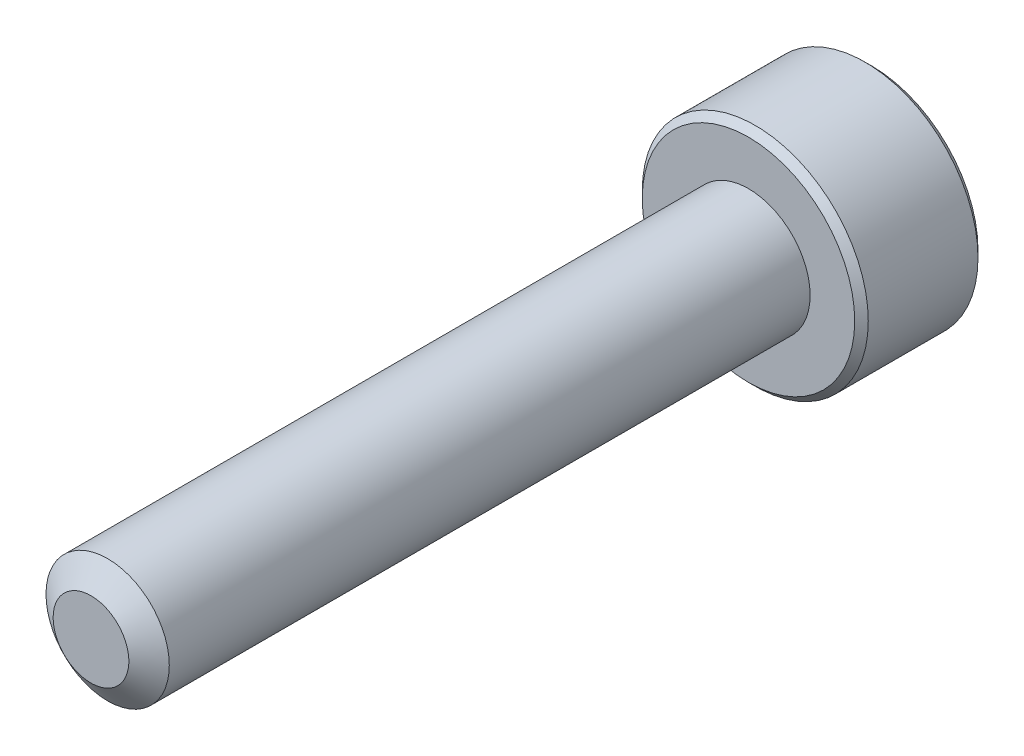
ISO-10303-21;
HEADER;
FILE_DESCRIPTION(('STEP AP214'),'2;1');
FILE_NAME('part.step','',(''),(''),'','','');
FILE_SCHEMA(('AUTOMOTIVE_DESIGN { 1 0 10303 214 1 1 1 1 }'));
ENDSEC;
DATA;
#1=APPLICATION_CONTEXT('core data for automotive mechanical design processes');
#2=APPLICATION_PROTOCOL_DEFINITION('international standard','automotive_design',2000,#1);
#3=PRODUCT_CONTEXT('',#1,'mechanical');
#4=PRODUCT('Part','Part','',(#3));
#5=PRODUCT_RELATED_PRODUCT_CATEGORY('part','',(#4));
#6=PRODUCT_DEFINITION_FORMATION('','',#4);
#7=PRODUCT_DEFINITION_CONTEXT('part definition',#1,'design');
#8=PRODUCT_DEFINITION('design','',#6,#7);
#9=PRODUCT_DEFINITION_SHAPE('','',#8);
#10=(LENGTH_UNIT() NAMED_UNIT(*) SI_UNIT(.MILLI.,.METRE.));
#11=(NAMED_UNIT(*) PLANE_ANGLE_UNIT() SI_UNIT($,.RADIAN.));
#12=(NAMED_UNIT(*) SI_UNIT($,.STERADIAN.) SOLID_ANGLE_UNIT());
#13=UNCERTAINTY_MEASURE_WITH_UNIT(LENGTH_MEASURE(1.E-05),#10,'distance_accuracy_value','');
#14=(GEOMETRIC_REPRESENTATION_CONTEXT(3) GLOBAL_UNCERTAINTY_ASSIGNED_CONTEXT((#13)) GLOBAL_UNIT_ASSIGNED_CONTEXT((#10,
#11,#12)) REPRESENTATION_CONTEXT('',''));
#15=CARTESIAN_POINT('',(0.,0.,0.));
#16=DIRECTION('',(0.,0.,1.));
#17=DIRECTION('',(1.,0.,0.));
#18=AXIS2_PLACEMENT_3D('',#15,#16,#17);
#19=CARTESIAN_POINT('',(0.,-1.44337567297406,-31.125));
#20=DIRECTION('',(-0.5,-0.866025403784439,0.));
#21=DIRECTION('',(0.866025403784439,-0.5,0.));
#22=AXIS2_PLACEMENT_3D('',#19,#20,#21);
#23=PLANE('',#22);
#24=CARTESIAN_POINT('',(-1.24999999999717,-0.721687836488642,-33.0000000000106));
#25=CARTESIAN_POINT('',(-1.20703689149332,-0.746492598748561,-32.9752190397288));
#26=CARTESIAN_POINT('',(-1.16335543595186,-0.771712098864021,-32.9518937494737));
#27=CARTESIAN_POINT('',(-1.07428446543453,-0.823137247669182,-32.9091861389212));
#28=CARTESIAN_POINT('',(-1.02888648443339,-0.849347784220857,-32.8898275733605));
#29=CARTESIAN_POINT('',(-0.937343688520888,-0.902200042083308,-32.8566662159147));
#30=CARTESIAN_POINT('',(-0.891222174140675,-0.928828310826158,-32.8427800967852));
#31=CARTESIAN_POINT('',(-0.797964038890889,-0.982670920316744,-32.8213859018018));
#32=CARTESIAN_POINT('',(-0.750830264933363,-1.00988361739904,-32.8138618619236));
#33=CARTESIAN_POINT('',(-0.669590913521704,-1.05678717880536,-32.8070728277983));
#34=CARTESIAN_POINT('',(-0.635590177984265,-1.07641751262054,-32.8060681886568));
#35=CARTESIAN_POINT('',(-0.567648554675288,-1.11564362712716,-32.8077634952234));
#36=CARTESIAN_POINT('',(-0.533707681782046,-1.1352393992286,-32.8104642592638));
#37=CARTESIAN_POINT('',(-0.466153619735556,-1.174241755136,-32.8194142483471));
#38=CARTESIAN_POINT('',(-0.432540764897232,-1.19364814592514,-32.8256667730594));
#39=CARTESIAN_POINT('',(-0.365876260757523,-1.23213691533559,-32.8413835392478));
#40=CARTESIAN_POINT('',(-0.332824858668344,-1.25121915122887,-32.8508491588607));
#41=CARTESIAN_POINT('',(-0.248213569936006,-1.30006950155497,-32.8789283315821));
#42=CARTESIAN_POINT('',(-0.197186124432366,-1.32953021095255,-32.8996493450654));
#43=CARTESIAN_POINT('',(-0.0971276056230598,-1.38729902372182,-32.9463235058208));
#44=CARTESIAN_POINT('',(-0.0480906425396526,-1.41561052755827,-32.9722596212326));
#45=CARTESIAN_POINT('',(-2.75812678191915E-12,-1.44337567297245,-33.0000000000106));
#46=B_SPLINE_CURVE_WITH_KNOTS('',3,(#24,#25,#26,#27,#28,#29,#30,#31,#32,#33,#34,#35,#36,#37,#38,
#39,#40,#41,#42,#43,#44,#45),.UNSPECIFIED.,.F.,.F.,(4,2,2,2,2,2,2,2,2,2,4),(0.,
0.166478683225086,0.333926926831293,0.49871665851616,0.663091654625532,0.780745575557483,
0.898425484350494,1.01621489976924,1.13405490052339,1.32111591641066,1.50757565757899),.UNSPECIFIED.);
#47=CARTESIAN_POINT('',(-1.25000000000136,-0.721687836486222,-33.000000000013));
#48=VERTEX_POINT('',#47);
#49=CARTESIAN_POINT('',(-4.1514466084769E-12,-1.44337567297487,-33.000000000013));
#50=VERTEX_POINT('',#49);
#51=EDGE_CURVE('E21',#48,#50,#46,.T.);
#52=ORIENTED_EDGE('',*,*,#51,.F.);
#53=DIRECTION('',(0.,0.,1.));
#54=VECTOR('',#53,1.);
#55=CARTESIAN_POINT('',(-1.24999999999997,-0.721687836487032,-31.125));
#56=LINE('',#55,#54);
#57=CARTESIAN_POINT('',(-1.24999999999997,-0.72168783648703,-31.125));
#58=VERTEX_POINT('',#57);
#59=EDGE_CURVE('E104',#48,#58,#56,.T.);
#60=ORIENTED_EDGE('',*,*,#59,.T.);
#61=DIRECTION('',(0.866025403784439,-0.5,0.));
#62=VECTOR('',#61,1.);
#63=CARTESIAN_POINT('',(0.,-1.44337567297406,-31.125));
#64=LINE('',#63,#62);
#65=CARTESIAN_POINT('',(0.,-1.44337567297406,-31.125));
#66=VERTEX_POINT('',#65);
#67=EDGE_CURVE('E77',#66,#58,#64,.F.);
#68=ORIENTED_EDGE('',*,*,#67,.F.);
#69=DIRECTION('',(0.,0.,1.));
#70=VECTOR('',#69,1.);
#71=CARTESIAN_POINT('',(0.,-1.44337567297407,-31.125));
#72=LINE('',#71,#70);
#73=EDGE_CURVE('E76',#66,#50,#72,.F.);
#74=ORIENTED_EDGE('',*,*,#73,.T.);
#75=EDGE_LOOP('',(#52,#60,#68,#74));
#76=FACE_BOUND('',#75,.T.);
#77=ADVANCED_FACE('F17',(#76),#23,.F.);
#78=CARTESIAN_POINT('',(1.25000000000004,-0.721687836487033,-31.125));
#79=DIRECTION('',(0.5,-0.866025403784439,0.));
#80=DIRECTION('',(0.866025403784439,0.5,0.));
#81=AXIS2_PLACEMENT_3D('',#78,#79,#80);
#82=PLANE('',#81);
#83=CARTESIAN_POINT('',(2.83489010956945E-12,-1.44337567297245,-33.0000000000106));
#84=CARTESIAN_POINT('',(0.042963108506678,-1.41857091071253,-32.9752190397288));
#85=CARTESIAN_POINT('',(0.0866445640481438,-1.39335141059707,-32.9518937494737));
#86=CARTESIAN_POINT('',(0.175715534565476,-1.34192626179191,-32.9091861389212));
#87=CARTESIAN_POINT('',(0.22111351556662,-1.31571572524024,-32.8898275733605));
#88=CARTESIAN_POINT('',(0.31265631147912,-1.26286346737778,-32.8566662159147));
#89=CARTESIAN_POINT('',(0.358777825859332,-1.23623519863493,-32.8427800967852));
#90=CARTESIAN_POINT('',(0.452035961109118,-1.18239258914435,-32.8213859018018));
#91=CARTESIAN_POINT('',(0.499169735066647,-1.15517989206205,-32.8138618619236));
#92=CARTESIAN_POINT('',(0.580409086478308,-1.10827633065573,-32.8070728277983));
#93=CARTESIAN_POINT('',(0.614409822015747,-1.08864599684055,-32.8060681886568));
#94=CARTESIAN_POINT('',(0.682351445324725,-1.04941988233393,-32.8077634952234));
#95=CARTESIAN_POINT('',(0.716292318217967,-1.02982411023248,-32.8104642592638));
#96=CARTESIAN_POINT('',(0.783846380264458,-0.99082175432509,-32.8194142483471));
#97=CARTESIAN_POINT('',(0.817459235102782,-0.971415363535952,-32.8256667730594));
#98=CARTESIAN_POINT('',(0.884123739242492,-0.932926594125497,-32.8413835392478));
#99=CARTESIAN_POINT('',(0.91717514133167,-0.913844358232215,-32.8508491588607));
#100=CARTESIAN_POINT('',(1.00178643006401,-0.864994007906121,-32.8789283315821));
#101=CARTESIAN_POINT('',(1.05281387556764,-0.835533298508536,-32.8996493450655));
#102=CARTESIAN_POINT('',(1.15287239437694,-0.777764485739271,-32.9463235058209));
#103=CARTESIAN_POINT('',(1.20190935746035,-0.749452981902827,-32.9722596212326));
#104=CARTESIAN_POINT('',(1.24999999999724,-0.721687836488652,-33.0000000000106));
#105=B_SPLINE_CURVE_WITH_KNOTS('',3,(#83,#84,#85,#86,#87,#88,#89,#90,#91,#92,#93,#94,#95,#96,
#97,#98,#99,#100,#101,#102,#103,#104),.UNSPECIFIED.,.F.,.F.,(4,2,2,2,2,2,2,2,2,2,4),(0.,
0.166478683225087,0.333926926831297,0.498716658516165,0.663091654625542,0.780745575557495,
0.898425484350506,1.01621489976925,1.1340549005234,1.32111591641067,1.50757565757898),.UNSPECIFIED.);
#106=CARTESIAN_POINT('',(1.24999999999864,-0.721687836491063,-33.000000000013));
#107=VERTEX_POINT('',#106);
#108=EDGE_CURVE('E84',#50,#107,#105,.T.);
#109=ORIENTED_EDGE('',*,*,#108,.F.);
#110=ORIENTED_EDGE('',*,*,#73,.F.);
#111=DIRECTION('',(-0.866025403784441,-0.499999999999996,0.));
#112=VECTOR('',#111,1.);
#113=CARTESIAN_POINT('',(1.25000000000004,-0.721687836487033,-31.125));
#114=LINE('',#113,#112);
#115=CARTESIAN_POINT('',(1.25000000000004,-0.721687836487033,-31.125));
#116=VERTEX_POINT('',#115);
#117=EDGE_CURVE('E272',#116,#66,#114,.T.);
#118=ORIENTED_EDGE('',*,*,#117,.F.);
#119=DIRECTION('',(0.,0.,-1.));
#120=VECTOR('',#119,1.);
#121=CARTESIAN_POINT('',(1.25000000000004,-0.721687836487033,-31.125));
#122=LINE('',#121,#120);
#123=EDGE_CURVE('E103',#116,#107,#122,.T.);
#124=ORIENTED_EDGE('',*,*,#123,.T.);
#125=EDGE_LOOP('',(#109,#110,#118,#124));
#126=FACE_BOUND('',#125,.T.);
#127=ADVANCED_FACE('F101',(#126),#82,.F.);
#128=CARTESIAN_POINT('',(-1.24999999999997,-0.721687836487032,-31.125));
#129=DIRECTION('',(-1.,0.,0.));
#130=DIRECTION('',(0.,-1.,0.));
#131=AXIS2_PLACEMENT_3D('',#128,#129,#130);
#132=PLANE('',#131);
#133=CARTESIAN_POINT('',(-1.24999999999997,0.721687836483799,-33.0000000000106));
#134=CARTESIAN_POINT('',(-1.24999999999997,0.672078311963963,-32.9752190397288));
#135=CARTESIAN_POINT('',(-1.24999999999997,0.621639311733045,-32.9518937494737));
#136=CARTESIAN_POINT('',(-1.24999999999997,0.518789014122723,-32.9091861389212));
#137=CARTESIAN_POINT('',(-1.24999999999997,0.466367941019373,-32.8898275733605));
#138=CARTESIAN_POINT('',(-1.24999999999997,0.360663425294469,-32.8566662159147));
#139=CARTESIAN_POINT('',(-1.24999999999997,0.307406887808772,-32.8427800967852));
#140=CARTESIAN_POINT('',(-1.24999999999997,0.199721668827599,-32.8213859018018));
#141=CARTESIAN_POINT('',(-1.24999999999997,0.145296274662995,-32.8138618619237));
#142=CARTESIAN_POINT('',(-1.24999999999997,0.0514891518503692,-32.8070728277983));
#143=CARTESIAN_POINT('',(-1.24999999999997,0.0122284842199978,-32.8060681886569));
#144=CARTESIAN_POINT('',(-1.24999999999997,-0.0662237447932393,-32.8077634952234));
#145=CARTESIAN_POINT('',(-1.24999999999997,-0.105415288996128,-32.8104642592638));
#146=CARTESIAN_POINT('',(-1.24999999999997,-0.183420000810916,-32.8194142483471));
#147=CARTESIAN_POINT('',(-1.24999999999997,-0.222232782389193,-32.8256667730594));
#148=CARTESIAN_POINT('',(-1.24999999999997,-0.299210321210101,-32.8413835392478));
#149=CARTESIAN_POINT('',(-1.24999999999997,-0.337374792996665,-32.8508491588607));
#150=CARTESIAN_POINT('',(-1.24999999999997,-0.435075493648856,-32.8789283315821));
#151=CARTESIAN_POINT('',(-1.24999999999997,-0.493996912444026,-32.8996493450655));
#152=CARTESIAN_POINT('',(-1.24999999999997,-0.609534537982556,-32.9463235058209));
#153=CARTESIAN_POINT('',(-1.24999999999997,-0.666157545655446,-32.9722596212326));
#154=CARTESIAN_POINT('',(-1.24999999999997,-0.721687836483798,-33.0000000000106));
#155=B_SPLINE_CURVE_WITH_KNOTS('',3,(#133,#134,#135,#136,#137,#138,#139,#140,#141,#142,#143,
#144,#145,#146,#147,#148,#149,#150,#151,#152,#153,#154),.UNSPECIFIED.,.F.,.F.,(4,2,2,2,2,2,2,2,
2,2,4),(0.,0.166478683225082,0.333926926831291,0.498716658516156,0.663091654625532,
0.780745575557485,0.898425484350496,1.01621489976924,1.13405490052339,1.32111591641066,
1.50757565757897),.UNSPECIFIED.);
#156=CARTESIAN_POINT('',(-1.24999999999997,0.721687836488636,-33.000000000013));
#157=VERTEX_POINT('',#156);
#158=EDGE_CURVE('E61',#157,#48,#155,.T.);
#159=ORIENTED_EDGE('',*,*,#158,.F.);
#160=DIRECTION('',(0.,0.,1.));
#161=VECTOR('',#160,1.);
#162=CARTESIAN_POINT('',(-1.24999999999997,0.721687836487032,-31.125));
#163=LINE('',#162,#161);
#164=CARTESIAN_POINT('',(-1.24999999999997,0.721687836487032,-31.125));
#165=VERTEX_POINT('',#164);
#166=EDGE_CURVE('E249',#157,#165,#163,.T.);
#167=ORIENTED_EDGE('',*,*,#166,.T.);
#168=DIRECTION('',(0.,1.,0.));
#169=VECTOR('',#168,1.);
#170=CARTESIAN_POINT('',(-1.24999999999997,2.1650635094611,-31.125));
#171=LINE('',#170,#169);
#172=EDGE_CURVE('E268',#58,#165,#171,.T.);
#173=ORIENTED_EDGE('',*,*,#172,.F.);
#174=ORIENTED_EDGE('',*,*,#59,.F.);
#175=EDGE_LOOP('',(#159,#167,#173,#174));
#176=FACE_BOUND('',#175,.T.);
#177=ADVANCED_FACE('F122',(#176),#132,.F.);
#178=CARTESIAN_POINT('',(1.25000000000004,2.1650635094611,-31.125));
#179=DIRECTION('',(0.,0.,-1.));
#180=DIRECTION('',(-1.,0.,0.));
#181=AXIS2_PLACEMENT_3D('',#178,#179,#180);
#182=PLANE('',#181);
#183=ORIENTED_EDGE('',*,*,#67,.T.);
#184=ORIENTED_EDGE('',*,*,#172,.T.);
#185=DIRECTION('',(-0.866025403784439,-0.5,0.));
#186=VECTOR('',#185,1.);
#187=CARTESIAN_POINT('',(-1.24999999999997,0.721687836487032,-31.125));
#188=LINE('',#187,#186);
#189=CARTESIAN_POINT('',(0.,1.44337567297406,-31.125));
#190=VERTEX_POINT('',#189);
#191=EDGE_CURVE('E144',#165,#190,#188,.F.);
#192=ORIENTED_EDGE('',*,*,#191,.T.);
#193=DIRECTION('',(-0.866025403784439,0.5,0.));
#194=VECTOR('',#193,1.);
#195=CARTESIAN_POINT('',(0.,1.44337567297406,-31.125));
#196=LINE('',#195,#194);
#197=CARTESIAN_POINT('',(1.25000000000004,0.721687836487027,-31.125));
#198=VERTEX_POINT('',#197);
#199=EDGE_CURVE('E246',#190,#198,#196,.F.);
#200=ORIENTED_EDGE('',*,*,#199,.T.);
#201=DIRECTION('',(0.,1.,0.));
#202=VECTOR('',#201,1.);
#203=CARTESIAN_POINT('',(1.25000000000004,0.721687836487032,-31.125));
#204=LINE('',#203,#202);
#205=EDGE_CURVE('E263',#198,#116,#204,.F.);
#206=ORIENTED_EDGE('',*,*,#205,.T.);
#207=ORIENTED_EDGE('',*,*,#117,.T.);
#208=EDGE_LOOP('',(#183,#184,#192,#200,#206,#207));
#209=FACE_BOUND('',#208,.T.);
#210=ADVANCED_FACE('F126',(#209),#182,.T.);
#211=CARTESIAN_POINT('',(1.25000000000004,0.721687836487032,-31.125));
#212=DIRECTION('',(1.,0.,0.));
#213=DIRECTION('',(0.,0.,-1.));
#214=AXIS2_PLACEMENT_3D('',#211,#212,#213);
#215=PLANE('',#214);
#216=CARTESIAN_POINT('',(1.25000000000004,-0.721687836483767,-33.0000000000107));
#217=CARTESIAN_POINT('',(1.25000000000004,-0.672078311963933,-32.9752190397289));
#218=CARTESIAN_POINT('',(1.25000000000004,-0.621639311733015,-32.9518937494738));
#219=CARTESIAN_POINT('',(1.25000000000004,-0.518789014122694,-32.9091861389213));
#220=CARTESIAN_POINT('',(1.25000000000004,-0.466367941019346,-32.8898275733605));
#221=CARTESIAN_POINT('',(1.25000000000004,-0.360663425294448,-32.8566662159147));
#222=CARTESIAN_POINT('',(1.25000000000004,-0.307406887808754,-32.8427800967852));
#223=CARTESIAN_POINT('',(1.25000000000004,-0.199721668827587,-32.8213859018019));
#224=CARTESIAN_POINT('',(1.25000000000004,-0.145296274662986,-32.8138618619237));
#225=CARTESIAN_POINT('',(1.25000000000004,-0.0514891518503633,-32.8070728277984));
#226=CARTESIAN_POINT('',(1.25000000000004,-0.0122284842199925,-32.8060681886569));
#227=CARTESIAN_POINT('',(1.25000000000004,0.0662237447932437,-32.8077634952235));
#228=CARTESIAN_POINT('',(1.25000000000004,0.105415288996132,-32.8104642592638));
#229=CARTESIAN_POINT('',(1.25000000000004,0.18342000081092,-32.8194142483472));
#230=CARTESIAN_POINT('',(1.25000000000004,0.222232782389196,-32.8256667730595));
#231=CARTESIAN_POINT('',(1.25000000000004,0.299210321210105,-32.8413835392478));
#232=CARTESIAN_POINT('',(1.25000000000004,0.337374792996669,-32.8508491588608));
#233=CARTESIAN_POINT('',(1.25000000000004,0.435075493649002,-32.8789283315823));
#234=CARTESIAN_POINT('',(1.25000000000004,0.493996912444308,-32.8996493450656));
#235=CARTESIAN_POINT('',(1.25000000000004,0.609534537983101,-32.9463235058212));
#236=CARTESIAN_POINT('',(1.25000000000004,0.666157545656118,-32.972259621233));
#237=CARTESIAN_POINT('',(1.25000000000004,0.721687836484593,-33.0000000000111));
#238=B_SPLINE_CURVE_WITH_KNOTS('',3,(#216,#217,#218,#219,#220,#221,#222,#223,#224,#225,#226,
#227,#228,#229,#230,#231,#232,#233,#234,#235,#236,#237),.UNSPECIFIED.,.F.,.F.,(4,2,2,2,2,2,2,2,
2,2,4),(0.,0.16647868322508,0.333926926831281,0.498716658516137,0.663091654625503,
0.780745575557454,0.898425484350464,1.01621489976921,1.13405490052336,1.32111591641107,
1.50757565757982),.UNSPECIFIED.);
#239=CARTESIAN_POINT('',(1.25000000000039,0.721687836488437,-33.0000000000132));
#240=VERTEX_POINT('',#239);
#241=EDGE_CURVE('E40',#107,#240,#238,.T.);
#242=ORIENTED_EDGE('',*,*,#241,.F.);
#243=ORIENTED_EDGE('',*,*,#123,.F.);
#244=ORIENTED_EDGE('',*,*,#205,.F.);
#245=DIRECTION('',(0.,0.,1.));
#246=VECTOR('',#245,1.);
#247=CARTESIAN_POINT('',(1.25000000000004,0.721687836487027,-31.125));
#248=LINE('',#247,#246);
#249=EDGE_CURVE('E242',#198,#240,#248,.F.);
#250=ORIENTED_EDGE('',*,*,#249,.T.);
#251=EDGE_LOOP('',(#242,#243,#244,#250));
#252=FACE_BOUND('',#251,.T.);
#253=ADVANCED_FACE('F130',(#252),#215,.F.);
#254=CARTESIAN_POINT('',(-1.24999999999997,0.721687836487032,-31.125));
#255=DIRECTION('',(-0.5,0.866025403784439,0.));
#256=DIRECTION('',(-0.866025403784439,-0.5,0.));
#257=AXIS2_PLACEMENT_3D('',#254,#255,#256);
#258=PLANE('',#257);
#259=CARTESIAN_POINT('',(-2.04579466972307E-12,1.44337567297287,-33.000000000011));
#260=CARTESIAN_POINT('',(-0.0429631085059339,1.41857091071292,-32.9752190397292));
#261=CARTESIAN_POINT('',(-0.0866445640474436,1.39335141059744,-32.951893749474));
#262=CARTESIAN_POINT('',(-0.175715534564866,1.34192626179222,-32.9091861389215));
#263=CARTESIAN_POINT('',(-0.221113515566057,1.31571572524052,-32.8898275733607));
#264=CARTESIAN_POINT('',(-0.312656311478655,1.26286346737801,-32.8566662159148));
#265=CARTESIAN_POINT('',(-0.358777825858918,1.23623519863513,-32.8427800967853));
#266=CARTESIAN_POINT('',(-0.452035961108808,1.18239258914449,-32.8213859018019));
#267=CARTESIAN_POINT('',(-0.499169735066388,1.15517989206215,-32.8138618619237));
#268=CARTESIAN_POINT('',(-0.580409086478104,1.10827633065581,-32.8070728277983));
#269=CARTESIAN_POINT('',(-0.614409822015546,1.08864599684062,-32.8060681886569));
#270=CARTESIAN_POINT('',(-0.682351445324528,1.049419882334,-32.8077634952234));
#271=CARTESIAN_POINT('',(-0.716292318217773,1.02982411023255,-32.8104642592637));
#272=CARTESIAN_POINT('',(-0.783846380264269,0.990821754325158,-32.8194142483471));
#273=CARTESIAN_POINT('',(-0.817459235102595,0.971415363536018,-32.8256667730594));
#274=CARTESIAN_POINT('',(-0.88412373924231,0.932926594125561,-32.8413835392477));
#275=CARTESIAN_POINT('',(-0.917175141331492,0.913844358232277,-32.8508491588606));
#276=CARTESIAN_POINT('',(-1.00178643006385,0.86499400790617,-32.8789283315821));
#277=CARTESIAN_POINT('',(-1.0528138755675,0.835533298508575,-32.8996493450654));
#278=CARTESIAN_POINT('',(-1.15287239437684,0.77776448573929,-32.9463235058208));
#279=CARTESIAN_POINT('',(-1.20190935746026,0.749452981902834,-32.9722596212326));
#280=CARTESIAN_POINT('',(-1.24999999999717,0.721687836488648,-33.0000000000106));
#281=B_SPLINE_CURVE_WITH_KNOTS('',3,(#259,#260,#261,#262,#263,#264,#265,#266,#267,#268,#269,
#270,#271,#272,#273,#274,#275,#276,#277,#278,#279,#280),.UNSPECIFIED.,.F.,.F.,(4,2,2,2,2,2,2,2,
2,2,4),(0.,0.166478683225279,0.333926926831687,0.498716658516747,0.663091654626309,
0.78074557555827,0.898425484351288,1.01621489977004,1.1340549005242,1.32111591641152,
1.50757565757991),.UNSPECIFIED.);
#282=CARTESIAN_POINT('',(-1.72312106275415E-12,1.44337567297508,-33.0000000000132));
#283=VERTEX_POINT('',#282);
#284=EDGE_CURVE('E145',#283,#157,#281,.T.);
#285=ORIENTED_EDGE('',*,*,#284,.F.);
#286=DIRECTION('',(0.,0.,1.));
#287=VECTOR('',#286,1.);
#288=CARTESIAN_POINT('',(0.,1.44337567297406,-31.125));
#289=LINE('',#288,#287);
#290=EDGE_CURVE('E170',#283,#190,#289,.T.);
#291=ORIENTED_EDGE('',*,*,#290,.T.);
#292=ORIENTED_EDGE('',*,*,#191,.F.);
#293=ORIENTED_EDGE('',*,*,#166,.F.);
#294=EDGE_LOOP('',(#285,#291,#292,#293));
#295=FACE_BOUND('',#294,.T.);
#296=ADVANCED_FACE('F135',(#295),#258,.F.);
#297=CARTESIAN_POINT('',(0.,1.44337567297406,-31.125));
#298=DIRECTION('',(0.5,0.866025403784439,0.));
#299=DIRECTION('',(-0.866025403784439,0.5,0.));
#300=AXIS2_PLACEMENT_3D('',#297,#298,#299);
#301=PLANE('',#300);
#302=CARTESIAN_POINT('',(2.11148663087512E-12,1.44337567297286,-33.000000000011));
#303=CARTESIAN_POINT('',(0.042963108505999,1.41857091071292,-32.9752190397292));
#304=CARTESIAN_POINT('',(0.0866445640475093,1.39335141059743,-32.951893749474));
#305=CARTESIAN_POINT('',(0.175715534564934,1.34192626179222,-32.9091861389215));
#306=CARTESIAN_POINT('',(0.221113515566127,1.31571572524051,-32.8898275733607));
#307=CARTESIAN_POINT('',(0.312656311478726,1.262863467378,-32.8566662159148));
#308=CARTESIAN_POINT('',(0.358777825858988,1.23623519863513,-32.8427800967853));
#309=CARTESIAN_POINT('',(0.452035961108878,1.18239258914448,-32.8213859018018));
#310=CARTESIAN_POINT('',(0.49916973506646,1.15517989206215,-32.8138618619237));
#311=CARTESIAN_POINT('',(0.580409086478177,1.1082763306558,-32.8070728277983));
#312=CARTESIAN_POINT('',(0.614409822015618,1.08864599684061,-32.8060681886568));
#313=CARTESIAN_POINT('',(0.6823514453246,1.04941988233399,-32.8077634952234));
#314=CARTESIAN_POINT('',(0.716292318217845,1.02982411023255,-32.8104642592637));
#315=CARTESIAN_POINT('',(0.78384638026434,0.99082175432515,-32.8194142483471));
#316=CARTESIAN_POINT('',(0.817459235102667,0.971415363536011,-32.8256667730594));
#317=CARTESIAN_POINT('',(0.884123739242382,0.932926594125553,-32.8413835392477));
#318=CARTESIAN_POINT('',(0.917175141331564,0.913844358232269,-32.8508491588606));
#319=CARTESIAN_POINT('',(1.00178643006405,0.864994007906088,-32.8789283315821));
#320=CARTESIAN_POINT('',(1.05281387556783,0.835533298508423,-32.8996493450655));
#321=CARTESIAN_POINT('',(1.1528723943774,0.777764485739001,-32.9463235058211));
#322=CARTESIAN_POINT('',(1.20190935746094,0.74945298190248,-32.9722596212329));
#323=CARTESIAN_POINT('',(1.24999999999795,0.72168783648823,-33.000000000011));
#324=B_SPLINE_CURVE_WITH_KNOTS('',3,(#302,#303,#304,#305,#306,#307,#308,#309,#310,#311,#312,
#313,#314,#315,#316,#317,#318,#319,#320,#321,#322,#323),.UNSPECIFIED.,.F.,.F.,(4,2,2,2,2,2,2,2,
2,2,4),(0.,0.166478683225283,0.333926926831696,0.498716658516754,0.66309165462632,
0.78074557555828,0.898425484351298,1.01621489977005,1.13405490052421,1.32111591641199,
1.50757565758083),.UNSPECIFIED.);
#325=EDGE_CURVE('E162',#283,#240,#324,.T.);
#326=ORIENTED_EDGE('',*,*,#325,.T.);
#327=ORIENTED_EDGE('',*,*,#249,.F.);
#328=ORIENTED_EDGE('',*,*,#199,.F.);
#329=ORIENTED_EDGE('',*,*,#290,.F.);
#330=EDGE_LOOP('',(#326,#327,#328,#329));
#331=FACE_BOUND('',#330,.T.);
#332=ADVANCED_FACE('F172',(#331),#301,.F.);
#333=CARTESIAN_POINT('',(0.,0.,-32.9999999999586));
#334=DIRECTION('',(0.,0.,-1.));
#335=DIRECTION('',(-1.,0.,0.));
#336=AXIS2_PLACEMENT_3D('',#333,#334,#335);
#337=CONICAL_SURFACE('',#336,1.44337567292045,0.785398163397448);
#338=ORIENTED_EDGE('',*,*,#284,.T.);
#339=CARTESIAN_POINT('',(0.,0.,-33.0000000000155));
#340=DIRECTION('',(0.,0.,-1.));
#341=DIRECTION('',(-1.,0.,0.));
#342=AXIS2_PLACEMENT_3D('',#339,#340,#341);
#343=CIRCLE('',#342,1.44337567297729);
#344=EDGE_CURVE('E169',#283,#157,#343,.F.);
#345=ORIENTED_EDGE('',*,*,#344,.F.);
#346=EDGE_LOOP('',(#338,#345));
#347=FACE_BOUND('',#346,.T.);
#348=ADVANCED_FACE('F175',(#347),#337,.F.);
#349=CARTESIAN_POINT('',(0.,0.,-32.9999999999586));
#350=DIRECTION('',(0.,0.,-1.));
#351=DIRECTION('',(-1.,0.,0.));
#352=AXIS2_PLACEMENT_3D('',#349,#350,#351);
#353=CONICAL_SURFACE('',#352,1.44337567292045,0.785398163397448);
#354=CARTESIAN_POINT('',(0.,0.,-33.0000000000155));
#355=DIRECTION('',(0.,0.,-1.));
#356=DIRECTION('',(-1.,0.,0.));
#357=AXIS2_PLACEMENT_3D('',#354,#355,#356);
#358=CIRCLE('',#357,1.44337567297729);
#359=EDGE_CURVE('E94',#157,#48,#358,.F.);
#360=ORIENTED_EDGE('',*,*,#359,.F.);
#361=ORIENTED_EDGE('',*,*,#158,.T.);
#362=EDGE_LOOP('',(#360,#361));
#363=FACE_BOUND('',#362,.T.);
#364=ADVANCED_FACE('F179',(#363),#353,.F.);
#365=CARTESIAN_POINT('',(0.,0.,-32.9999999999586));
#366=DIRECTION('',(0.,0.,-1.));
#367=DIRECTION('',(-1.,0.,0.));
#368=AXIS2_PLACEMENT_3D('',#365,#366,#367);
#369=CONICAL_SURFACE('',#368,1.44337567292045,0.785398163397448);
#370=ORIENTED_EDGE('',*,*,#51,.T.);
#371=CARTESIAN_POINT('',(0.,0.,-33.0000000000155));
#372=DIRECTION('',(0.,0.,-1.));
#373=DIRECTION('',(-1.,0.,0.));
#374=AXIS2_PLACEMENT_3D('',#371,#372,#373);
#375=CIRCLE('',#374,1.44337567297729);
#376=EDGE_CURVE('E72',#48,#50,#375,.F.);
#377=ORIENTED_EDGE('',*,*,#376,.F.);
#378=EDGE_LOOP('',(#370,#377));
#379=FACE_BOUND('',#378,.T.);
#380=ADVANCED_FACE('F70',(#379),#369,.F.);
#381=CARTESIAN_POINT('',(0.,0.,-32.9999999999586));
#382=DIRECTION('',(0.,0.,-1.));
#383=DIRECTION('',(-1.,0.,0.));
#384=AXIS2_PLACEMENT_3D('',#381,#382,#383);
#385=CONICAL_SURFACE('',#384,1.44337567292045,0.785398163397448);
#386=ORIENTED_EDGE('',*,*,#108,.T.);
#387=CARTESIAN_POINT('',(0.,0.,-33.0000000000155));
#388=DIRECTION('',(0.,0.,-1.));
#389=DIRECTION('',(-1.,0.,0.));
#390=AXIS2_PLACEMENT_3D('',#387,#388,#389);
#391=CIRCLE('',#390,1.44337567297729);
#392=EDGE_CURVE('E92',#50,#107,#391,.F.);
#393=ORIENTED_EDGE('',*,*,#392,.F.);
#394=EDGE_LOOP('',(#386,#393));
#395=FACE_BOUND('',#394,.T.);
#396=ADVANCED_FACE('F97',(#395),#385,.F.);
#397=CARTESIAN_POINT('',(0.,0.,-32.9999999999586));
#398=DIRECTION('',(0.,0.,-1.));
#399=DIRECTION('',(-1.,0.,0.));
#400=AXIS2_PLACEMENT_3D('',#397,#398,#399);
#401=CONICAL_SURFACE('',#400,1.44337567292038,0.785398163397448);
#402=ORIENTED_EDGE('',*,*,#241,.T.);
#403=CARTESIAN_POINT('',(0.,0.,-33.0000000000155));
#404=DIRECTION('',(0.,0.,-1.));
#405=DIRECTION('',(-1.,0.,0.));
#406=AXIS2_PLACEMENT_3D('',#403,#404,#405);
#407=CIRCLE('',#406,1.44337567297722);
#408=EDGE_CURVE('E99',#107,#240,#407,.F.);
#409=ORIENTED_EDGE('',*,*,#408,.F.);
#410=EDGE_LOOP('',(#402,#409));
#411=FACE_BOUND('',#410,.T.);
#412=ADVANCED_FACE('F152',(#411),#401,.F.);
#413=CARTESIAN_POINT('',(0.,0.,-32.9999999999586));
#414=DIRECTION('',(0.,0.,-1.));
#415=DIRECTION('',(-1.,0.,0.));
#416=AXIS2_PLACEMENT_3D('',#413,#414,#415);
#417=CONICAL_SURFACE('',#416,1.44337567292045,0.785398163397448);
#418=ORIENTED_EDGE('',*,*,#325,.F.);
#419=CARTESIAN_POINT('',(0.,0.,-33.0000000000155));
#420=DIRECTION('',(0.,0.,-1.));
#421=DIRECTION('',(-1.,0.,0.));
#422=AXIS2_PLACEMENT_3D('',#419,#420,#421);
#423=CIRCLE('',#422,1.44337567297729);
#424=EDGE_CURVE('E234',#240,#283,#423,.F.);
#425=ORIENTED_EDGE('',*,*,#424,.F.);
#426=EDGE_LOOP('',(#418,#425));
#427=FACE_BOUND('',#426,.T.);
#428=ADVANCED_FACE('F156',(#427),#417,.F.);
#429=CARTESIAN_POINT('',(0.,0.,-33.));
#430=DIRECTION('',(0.,0.,-1.));
#431=DIRECTION('',(-1.,0.,0.));
#432=AXIS2_PLACEMENT_3D('',#429,#430,#431);
#433=PLANE('',#432);
#434=ORIENTED_EDGE('',*,*,#408,.T.);
#435=ORIENTED_EDGE('',*,*,#424,.T.);
#436=ORIENTED_EDGE('',*,*,#344,.T.);
#437=ORIENTED_EDGE('',*,*,#359,.T.);
#438=ORIENTED_EDGE('',*,*,#376,.T.);
#439=ORIENTED_EDGE('',*,*,#392,.T.);
#440=EDGE_LOOP('',(#434,#435,#436,#437,#438,#439));
#441=FACE_BOUND('',#440,.T.);
#442=CARTESIAN_POINT('',(0.,0.,-33.0000000000154));
#443=DIRECTION('',(0.,0.,1.));
#444=DIRECTION('',(1.,0.,0.));
#445=AXIS2_PLACEMENT_3D('',#442,#443,#444);
#446=CIRCLE('',#445,2.58500000006734);
#447=CARTESIAN_POINT('',(2.58500000006737,0.,-33.0000000000154));
#448=VERTEX_POINT('',#447);
#449=EDGE_CURVE('E225',#448,#448,#446,.T.);
#450=ORIENTED_EDGE('',*,*,#449,.F.);
#451=EDGE_LOOP('',(#450));
#452=FACE_BOUND('',#451,.T.);
#453=ADVANCED_FACE('F90',(#441,#452),#433,.T.);
#454=CARTESIAN_POINT('',(0.,0.,-32.8350000000341));
#455=DIRECTION('',(0.,0.,1.));
#456=DIRECTION('',(1.,0.,0.));
#457=AXIS2_PLACEMENT_3D('',#454,#455,#456);
#458=CONICAL_SURFACE('',#457,2.75000000004862,0.785398163397448);
#459=ORIENTED_EDGE('',*,*,#449,.T.);
#460=EDGE_LOOP('',(#459));
#461=FACE_BOUND('',#460,.T.);
#462=CARTESIAN_POINT('',(0.,0.,-32.835));
#463=DIRECTION('',(0.,0.,1.));
#464=DIRECTION('',(1.,0.,0.));
#465=AXIS2_PLACEMENT_3D('',#462,#463,#464);
#466=CIRCLE('',#465,2.75);
#467=CARTESIAN_POINT('',(2.75000000000004,0.,-32.835));
#468=VERTEX_POINT('',#467);
#469=EDGE_CURVE('E228',#468,#468,#466,.T.);
#470=ORIENTED_EDGE('',*,*,#469,.F.);
#471=EDGE_LOOP('',(#470));
#472=FACE_BOUND('',#471,.T.);
#473=ADVANCED_FACE('F215',(#461,#472),#458,.T.);
#474=CARTESIAN_POINT('',(0.,0.,-33.));
#475=DIRECTION('',(0.,0.,1.));
#476=DIRECTION('',(1.,0.,0.));
#477=AXIS2_PLACEMENT_3D('',#474,#475,#476);
#478=CYLINDRICAL_SURFACE('',#477,2.75);
#479=ORIENTED_EDGE('',*,*,#469,.T.);
#480=EDGE_LOOP('',(#479));
#481=FACE_BOUND('',#480,.T.);
#482=CARTESIAN_POINT('',(0.,0.,-30.1650000000109));
#483=DIRECTION('',(0.,0.,-1.));
#484=DIRECTION('',(-1.,0.,0.));
#485=AXIS2_PLACEMENT_3D('',#482,#483,#484);
#486=CIRCLE('',#485,2.74999999999185);
#487=CARTESIAN_POINT('',(-2.74999999999181,0.,-30.1650000000109));
#488=VERTEX_POINT('',#487);
#489=EDGE_CURVE('E229',#488,#488,#486,.F.);
#490=ORIENTED_EDGE('',*,*,#489,.F.);
#491=EDGE_LOOP('',(#490));
#492=FACE_BOUND('',#491,.T.);
#493=ADVANCED_FACE('F212',(#481,#492),#478,.T.);
#494=CARTESIAN_POINT('',(0.,0.,-14.));
#495=DIRECTION('',(0.,0.,1.));
#496=DIRECTION('',(1.,0.,0.));
#497=AXIS2_PLACEMENT_3D('',#494,#495,#496);
#498=PLANE('',#497);
#499=CARTESIAN_POINT('',(0.,0.,-13.9999999999532));
#500=DIRECTION('',(0.,0.,-1.));
#501=DIRECTION('',(-1.,0.,0.));
#502=AXIS2_PLACEMENT_3D('',#499,#500,#501);
#503=CIRCLE('',#502,0.921240473587659);
#504=CARTESIAN_POINT('',(-0.921240473587661,0.,-13.9999999999532));
#505=VERTEX_POINT('',#504);
#506=EDGE_CURVE('E232',#505,#505,#503,.T.);
#507=ORIENTED_EDGE('',*,*,#506,.F.);
#508=EDGE_LOOP('',(#507));
#509=FACE_BOUND('',#508,.T.);
#510=ADVANCED_FACE('F208',(#509),#498,.T.);
#511=CARTESIAN_POINT('',(0.,0.,-30.1649999998972));
#512=DIRECTION('',(0.,0.,-1.));
#513=DIRECTION('',(-1.,0.,0.));
#514=AXIS2_PLACEMENT_3D('',#511,#512,#513);
#515=CONICAL_SURFACE('',#514,2.74999999993501,0.785398163569701);
#516=CARTESIAN_POINT('',(0.,0.,-30.0000000000295));
#517=DIRECTION('',(0.,0.,-1.));
#518=DIRECTION('',(-1.,0.,0.));
#519=AXIS2_PLACEMENT_3D('',#516,#517,#518);
#520=CIRCLE('',#519,2.5850000000105);
#521=CARTESIAN_POINT('',(-2.58500000001046,0.,-30.0000000000295));
#522=VERTEX_POINT('',#521);
#523=EDGE_CURVE('E287',#522,#522,#520,.T.);
#524=ORIENTED_EDGE('',*,*,#523,.T.);
#525=EDGE_LOOP('',(#524));
#526=FACE_BOUND('',#525,.T.);
#527=ORIENTED_EDGE('',*,*,#489,.T.);
#528=EDGE_LOOP('',(#527));
#529=FACE_BOUND('',#528,.T.);
#530=ADVANCED_FACE('F204',(#526,#529),#515,.T.);
#531=CARTESIAN_POINT('',(0.,0.,-14.4052517831597));
#532=DIRECTION('',(0.,0.,-1.));
#533=DIRECTION('',(-1.,0.,0.));
#534=AXIS2_PLACEMENT_3D('',#531,#532,#533);
#535=CONICAL_SURFACE('',#534,1.50000000002137,0.959931088612039);
#536=ORIENTED_EDGE('',*,*,#506,.T.);
#537=EDGE_LOOP('',(#536));
#538=FACE_BOUND('',#537,.T.);
#539=CARTESIAN_POINT('',(0.,0.,-14.4052517832094));
#540=DIRECTION('',(0.,0.,1.));
#541=DIRECTION('',(1.,0.,0.));
#542=AXIS2_PLACEMENT_3D('',#539,#540,#541);
#543=CIRCLE('',#542,1.5);
#544=CARTESIAN_POINT('',(1.5,0.,-14.4052517832094));
#545=VERTEX_POINT('',#544);
#546=EDGE_CURVE('E32',#545,#545,#543,.F.);
#547=ORIENTED_EDGE('',*,*,#546,.F.);
#548=EDGE_LOOP('',(#547));
#549=FACE_BOUND('',#548,.T.);
#550=ADVANCED_FACE('F197',(#538,#549),#535,.T.);
#551=CARTESIAN_POINT('',(0.,0.,-30.));
#552=DIRECTION('',(0.,0.,-1.));
#553=DIRECTION('',(-1.,0.,0.));
#554=AXIS2_PLACEMENT_3D('',#551,#552,#553);
#555=PLANE('',#554);
#556=CARTESIAN_POINT('',(0.,0.,-30.));
#557=DIRECTION('',(0.,0.,1.));
#558=DIRECTION('',(1.,0.,0.));
#559=AXIS2_PLACEMENT_3D('',#556,#557,#558);
#560=CIRCLE('',#559,1.5);
#561=CARTESIAN_POINT('',(1.5,0.,-30.));
#562=VERTEX_POINT('',#561);
#563=EDGE_CURVE('E11',#562,#562,#560,.T.);
#564=ORIENTED_EDGE('',*,*,#563,.F.);
#565=EDGE_LOOP('',(#564));
#566=FACE_BOUND('',#565,.T.);
#567=ORIENTED_EDGE('',*,*,#523,.F.);
#568=EDGE_LOOP('',(#567));
#569=FACE_BOUND('',#568,.T.);
#570=ADVANCED_FACE('F191',(#566,#569),#555,.F.);
#571=CARTESIAN_POINT('',(0.,0.,-40.));
#572=DIRECTION('',(0.,0.,1.));
#573=DIRECTION('',(1.,0.,0.));
#574=AXIS2_PLACEMENT_3D('',#571,#572,#573);
#575=CYLINDRICAL_SURFACE('',#574,1.5);
#576=ORIENTED_EDGE('',*,*,#563,.T.);
#577=EDGE_LOOP('',(#576));
#578=FACE_BOUND('',#577,.T.);
#579=ORIENTED_EDGE('',*,*,#546,.T.);
#580=EDGE_LOOP('',(#579));
#581=FACE_BOUND('',#580,.T.);
#582=ADVANCED_FACE('F189',(#578,#581),#575,.T.);
#583=CLOSED_SHELL('',(#77,#127,#177,#210,#253,#296,#332,#348,#364,#380,#396,#412,#428,#453,#473,
#493,#510,#530,#550,#570,#582));
#584=MANIFOLD_SOLID_BREP('B1',#583);
#585=ADVANCED_BREP_SHAPE_REPRESENTATION('',(#18,#584),#14);
#586=SHAPE_DEFINITION_REPRESENTATION(#9,#585);
ENDSEC;
END-ISO-10303-21;
